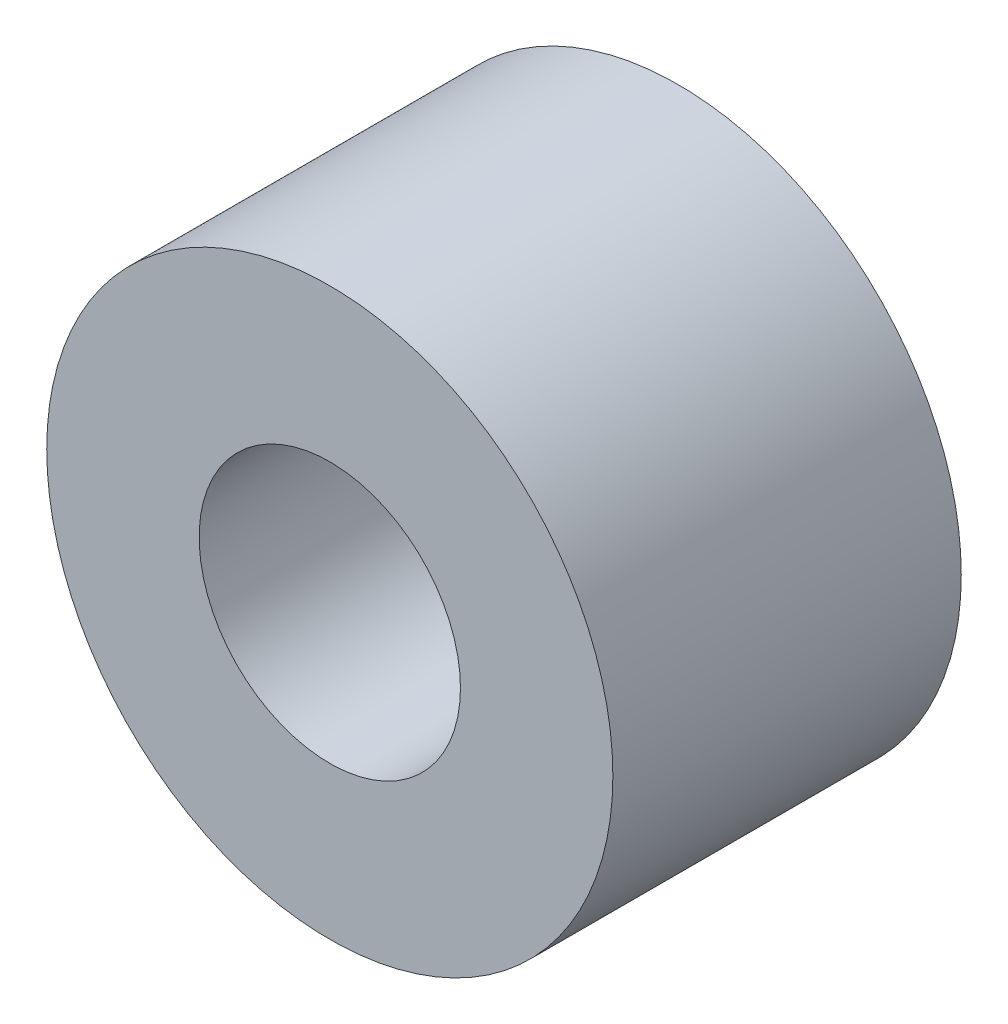
ISO-10303-21;
HEADER;
FILE_DESCRIPTION(('STEP AP214'),'2;1');
FILE_NAME('part.step','',(''),(''),'','','');
FILE_SCHEMA(('AUTOMOTIVE_DESIGN { 1 0 10303 214 1 1 1 1 }'));
ENDSEC;
DATA;
#1=APPLICATION_CONTEXT('core data for automotive mechanical design processes');
#2=APPLICATION_PROTOCOL_DEFINITION('international standard','automotive_design',2000,#1);
#3=PRODUCT_CONTEXT('',#1,'mechanical');
#4=PRODUCT('Part','Part','',(#3));
#5=PRODUCT_RELATED_PRODUCT_CATEGORY('part','',(#4));
#6=PRODUCT_DEFINITION_FORMATION('','',#4);
#7=PRODUCT_DEFINITION_CONTEXT('part definition',#1,'design');
#8=PRODUCT_DEFINITION('design','',#6,#7);
#9=PRODUCT_DEFINITION_SHAPE('','',#8);
#10=(LENGTH_UNIT() NAMED_UNIT(*) SI_UNIT(.MILLI.,.METRE.));
#11=(NAMED_UNIT(*) PLANE_ANGLE_UNIT() SI_UNIT($,.RADIAN.));
#12=(NAMED_UNIT(*) SI_UNIT($,.STERADIAN.) SOLID_ANGLE_UNIT());
#13=UNCERTAINTY_MEASURE_WITH_UNIT(LENGTH_MEASURE(1.E-05),#10,'distance_accuracy_value','');
#14=(GEOMETRIC_REPRESENTATION_CONTEXT(3) GLOBAL_UNCERTAINTY_ASSIGNED_CONTEXT((#13)) GLOBAL_UNIT_ASSIGNED_CONTEXT((#10,
#11,#12)) REPRESENTATION_CONTEXT('',''));
#15=CARTESIAN_POINT('',(0.,0.,0.));
#16=DIRECTION('',(0.,0.,1.));
#17=DIRECTION('',(1.,0.,0.));
#18=AXIS2_PLACEMENT_3D('',#15,#16,#17);
#19=CARTESIAN_POINT('',(0.,0.,4.));
#20=DIRECTION('',(0.,0.,1.));
#21=DIRECTION('',(1.,0.,0.));
#22=AXIS2_PLACEMENT_3D('',#19,#20,#21);
#23=PLANE('',#22);
#24=CARTESIAN_POINT('',(0.,0.,4.));
#25=DIRECTION('',(0.,0.,1.));
#26=DIRECTION('',(1.,0.,0.));
#27=AXIS2_PLACEMENT_3D('',#24,#25,#26);
#28=CIRCLE('',#27,3.25);
#29=CARTESIAN_POINT('',(3.25,0.,4.));
#30=VERTEX_POINT('',#29);
#31=EDGE_CURVE('E11',#30,#30,#28,.T.);
#32=ORIENTED_EDGE('',*,*,#31,.T.);
#33=EDGE_LOOP('',(#32));
#34=FACE_BOUND('',#33,.T.);
#35=CARTESIAN_POINT('',(0.,0.,4.));
#36=DIRECTION('',(0.,0.,1.));
#37=DIRECTION('',(1.,0.,0.));
#38=AXIS2_PLACEMENT_3D('',#35,#36,#37);
#39=CIRCLE('',#38,1.5);
#40=CARTESIAN_POINT('',(1.5,0.,4.));
#41=VERTEX_POINT('',#40);
#42=EDGE_CURVE('E60',#41,#41,#39,.T.);
#43=ORIENTED_EDGE('',*,*,#42,.F.);
#44=EDGE_LOOP('',(#43));
#45=FACE_BOUND('',#44,.T.);
#46=ADVANCED_FACE('F47',(#34,#45),#23,.T.);
#47=CARTESIAN_POINT('',(0.,0.,0.));
#48=DIRECTION('',(0.,0.,1.));
#49=DIRECTION('',(1.,0.,0.));
#50=AXIS2_PLACEMENT_3D('',#47,#48,#49);
#51=PLANE('',#50);
#52=CARTESIAN_POINT('',(0.,0.,0.));
#53=DIRECTION('',(0.,0.,1.));
#54=DIRECTION('',(1.,0.,0.));
#55=AXIS2_PLACEMENT_3D('',#52,#53,#54);
#56=CIRCLE('',#55,3.25);
#57=CARTESIAN_POINT('',(3.25,0.,0.));
#58=VERTEX_POINT('',#57);
#59=EDGE_CURVE('E51',#58,#58,#56,.T.);
#60=ORIENTED_EDGE('',*,*,#59,.F.);
#61=EDGE_LOOP('',(#60));
#62=FACE_BOUND('',#61,.T.);
#63=CARTESIAN_POINT('',(0.,0.,0.));
#64=DIRECTION('',(0.,0.,1.));
#65=DIRECTION('',(1.,0.,0.));
#66=AXIS2_PLACEMENT_3D('',#63,#64,#65);
#67=CIRCLE('',#66,1.5);
#68=CARTESIAN_POINT('',(1.5,0.,0.));
#69=VERTEX_POINT('',#68);
#70=EDGE_CURVE('E62',#69,#69,#67,.T.);
#71=ORIENTED_EDGE('',*,*,#70,.T.);
#72=EDGE_LOOP('',(#71));
#73=FACE_BOUND('',#72,.T.);
#74=ADVANCED_FACE('F74',(#62,#73),#51,.F.);
#75=CARTESIAN_POINT('',(0.,0.,4.));
#76=DIRECTION('',(0.,0.,-1.));
#77=DIRECTION('',(-1.,0.,0.));
#78=AXIS2_PLACEMENT_3D('',#75,#76,#77);
#79=CYLINDRICAL_SURFACE('',#78,3.25);
#80=ORIENTED_EDGE('',*,*,#31,.F.);
#81=EDGE_LOOP('',(#80));
#82=FACE_BOUND('',#81,.T.);
#83=ORIENTED_EDGE('',*,*,#59,.T.);
#84=EDGE_LOOP('',(#83));
#85=FACE_BOUND('',#84,.T.);
#86=ADVANCED_FACE('F49',(#82,#85),#79,.T.);
#87=CARTESIAN_POINT('',(0.,0.,4.));
#88=DIRECTION('',(0.,0.,-1.));
#89=DIRECTION('',(-1.,0.,0.));
#90=AXIS2_PLACEMENT_3D('',#87,#88,#89);
#91=CYLINDRICAL_SURFACE('',#90,1.5);
#92=ORIENTED_EDGE('',*,*,#42,.T.);
#93=EDGE_LOOP('',(#92));
#94=FACE_BOUND('',#93,.T.);
#95=ORIENTED_EDGE('',*,*,#70,.F.);
#96=EDGE_LOOP('',(#95));
#97=FACE_BOUND('',#96,.T.);
#98=ADVANCED_FACE('F70',(#94,#97),#91,.F.);
#99=CLOSED_SHELL('',(#46,#74,#86,#98));
#100=MANIFOLD_SOLID_BREP('B2',#99);
#101=ADVANCED_BREP_SHAPE_REPRESENTATION('',(#18,#100),#14);
#102=SHAPE_DEFINITION_REPRESENTATION(#9,#101);
ENDSEC;
END-ISO-10303-21;
